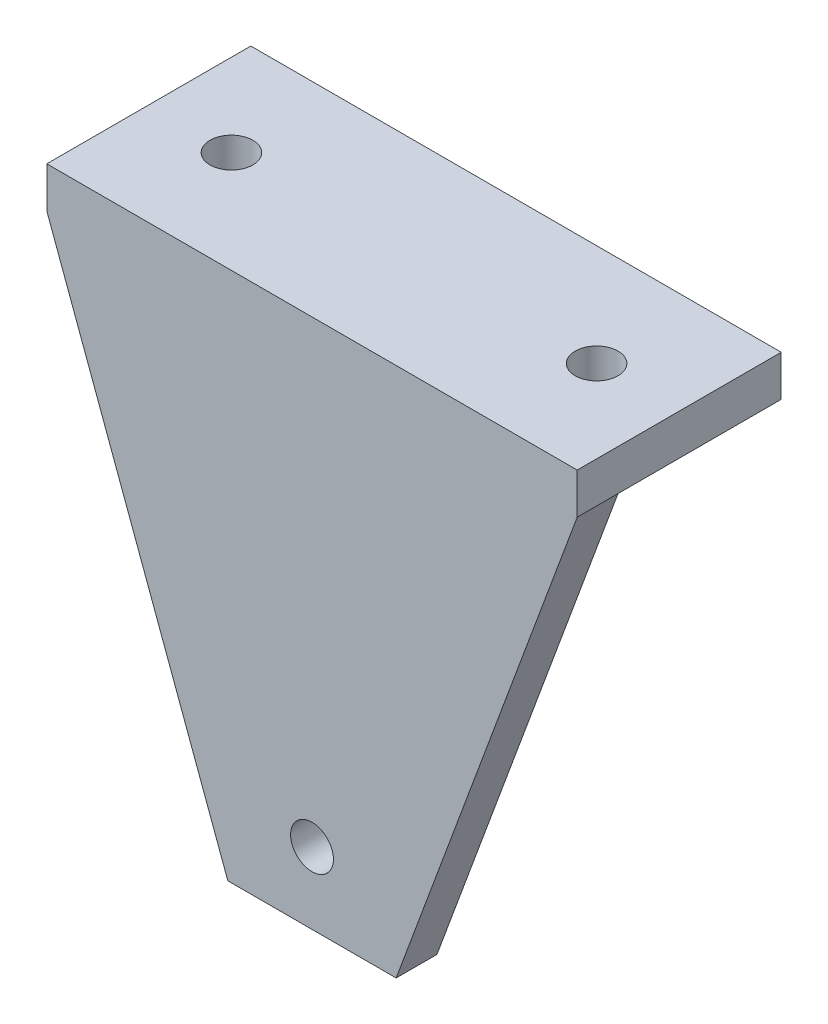
ISO-10303-21;
HEADER;
FILE_DESCRIPTION(('STEP AP214'),'2;1');
FILE_NAME('part.step','',(''),(''),'','','');
FILE_SCHEMA(('AUTOMOTIVE_DESIGN { 1 0 10303 214 1 1 1 1 }'));
ENDSEC;
DATA;
#1=APPLICATION_CONTEXT('core data for automotive mechanical design processes');
#2=APPLICATION_PROTOCOL_DEFINITION('international standard','automotive_design',2000,#1);
#3=PRODUCT_CONTEXT('',#1,'mechanical');
#4=PRODUCT('Part','Part','',(#3));
#5=PRODUCT_RELATED_PRODUCT_CATEGORY('part','',(#4));
#6=PRODUCT_DEFINITION_FORMATION('','',#4);
#7=PRODUCT_DEFINITION_CONTEXT('part definition',#1,'design');
#8=PRODUCT_DEFINITION('design','',#6,#7);
#9=PRODUCT_DEFINITION_SHAPE('','',#8);
#10=(LENGTH_UNIT() NAMED_UNIT(*) SI_UNIT(.MILLI.,.METRE.));
#11=(NAMED_UNIT(*) PLANE_ANGLE_UNIT() SI_UNIT($,.RADIAN.));
#12=(NAMED_UNIT(*) SI_UNIT($,.STERADIAN.) SOLID_ANGLE_UNIT());
#13=UNCERTAINTY_MEASURE_WITH_UNIT(LENGTH_MEASURE(1.E-05),#10,'distance_accuracy_value','');
#14=(GEOMETRIC_REPRESENTATION_CONTEXT(3) GLOBAL_UNCERTAINTY_ASSIGNED_CONTEXT((#13)) GLOBAL_UNIT_ASSIGNED_CONTEXT((#10,
#11,#12)) REPRESENTATION_CONTEXT('',''));
#15=CARTESIAN_POINT('',(0.,0.,0.));
#16=DIRECTION('',(0.,0.,1.));
#17=DIRECTION('',(1.,0.,0.));
#18=AXIS2_PLACEMENT_3D('',#15,#16,#17);
#19=CARTESIAN_POINT('',(0.,0.,0.));
#20=DIRECTION('',(0.,-1.,0.));
#21=DIRECTION('',(0.,0.,-1.));
#22=AXIS2_PLACEMENT_3D('',#19,#20,#21);
#23=PLANE('',#22);
#24=CARTESIAN_POINT('',(8.1,0.,-10.));
#25=DIRECTION('',(0.,1.,0.));
#26=DIRECTION('',(0.,0.,-1.));
#27=AXIS2_PLACEMENT_3D('',#24,#25,#26);
#28=CIRCLE('',#27,2.1);
#29=CARTESIAN_POINT('',(8.1,0.,-12.1));
#30=VERTEX_POINT('',#29);
#31=EDGE_CURVE('E206',#30,#30,#28,.T.);
#32=ORIENTED_EDGE('',*,*,#31,.T.);
#33=EDGE_LOOP('',(#32));
#34=FACE_BOUND('',#33,.T.);
#35=DIRECTION('',(-1.,0.,0.));
#36=VECTOR('',#35,1.);
#37=CARTESIAN_POINT('',(0.,0.,-20.));
#38=LINE('',#37,#36);
#39=CARTESIAN_POINT('',(13.9877317805303,0.,-20.));
#40=VERTEX_POINT('',#39);
#41=CARTESIAN_POINT('',(0.,0.,-20.));
#42=VERTEX_POINT('',#41);
#43=EDGE_CURVE('E77',#40,#42,#38,.T.);
#44=ORIENTED_EDGE('',*,*,#43,.F.);
#45=DIRECTION('',(0.,0.,1.));
#46=VECTOR('',#45,1.);
#47=CARTESIAN_POINT('',(13.9877317805303,0.,-20.));
#48=LINE('',#47,#46);
#49=CARTESIAN_POINT('',(13.9877317805303,0.,-4.00000000000001));
#50=VERTEX_POINT('',#49);
#51=EDGE_CURVE('E259',#40,#50,#48,.T.);
#52=ORIENTED_EDGE('',*,*,#51,.T.);
#53=DIRECTION('',(1.,0.,0.));
#54=VECTOR('',#53,1.);
#55=CARTESIAN_POINT('',(52.,0.,-4.));
#56=LINE('',#55,#54);
#57=CARTESIAN_POINT('',(0.,0.,-4.00000000000001));
#58=VERTEX_POINT('',#57);
#59=EDGE_CURVE('E184',#58,#50,#56,.T.);
#60=ORIENTED_EDGE('',*,*,#59,.F.);
#61=DIRECTION('',(0.,0.,1.));
#62=VECTOR('',#61,1.);
#63=CARTESIAN_POINT('',(0.,0.,0.));
#64=LINE('',#63,#62);
#65=EDGE_CURVE('E218',#42,#58,#64,.T.);
#66=ORIENTED_EDGE('',*,*,#65,.F.);
#67=EDGE_LOOP('',(#44,#52,#60,#66));
#68=FACE_BOUND('',#67,.T.);
#69=ADVANCED_FACE('F38',(#34,#68),#23,.T.);
#70=CARTESIAN_POINT('',(18.,0.,-4.));
#71=VERTEX_POINT('',#70);
#72=CARTESIAN_POINT('',(34.,0.,-4.));
#73=VERTEX_POINT('',#72);
#74=EDGE_CURVE('E182',#71,#73,#56,.T.);
#75=ORIENTED_EDGE('',*,*,#74,.F.);
#76=DIRECTION('',(0.,0.,1.));
#77=VECTOR('',#76,1.);
#78=CARTESIAN_POINT('',(18.,0.,-20.));
#79=LINE('',#78,#77);
#80=CARTESIAN_POINT('',(18.,0.,-20.));
#81=VERTEX_POINT('',#80);
#82=EDGE_CURVE('E262',#81,#71,#79,.T.);
#83=ORIENTED_EDGE('',*,*,#82,.F.);
#84=CARTESIAN_POINT('',(34.,0.,-20.));
#85=VERTEX_POINT('',#84);
#86=EDGE_CURVE('E235',#85,#81,#38,.T.);
#87=ORIENTED_EDGE('',*,*,#86,.F.);
#88=DIRECTION('',(0.,0.,1.));
#89=VECTOR('',#88,1.);
#90=CARTESIAN_POINT('',(34.,0.,-20.));
#91=LINE('',#90,#89);
#92=EDGE_CURVE('E197',#85,#73,#91,.T.);
#93=ORIENTED_EDGE('',*,*,#92,.T.);
#94=EDGE_LOOP('',(#75,#83,#87,#93));
#95=FACE_BOUND('',#94,.T.);
#96=ADVANCED_FACE('F294',(#95),#23,.T.);
#97=CARTESIAN_POINT('',(52.,-48.,-4.));
#98=DIRECTION('',(0.,0.,1.));
#99=DIRECTION('',(1.,0.,0.));
#100=AXIS2_PLACEMENT_3D('',#97,#98,#99);
#101=PLANE('',#100);
#102=DIRECTION('',(-0.078140925400026,0.996942323195092,0.));
#103=VECTOR('',#102,1.);
#104=CARTESIAN_POINT('',(17.75,-48.,-4.));
#105=LINE('',#104,#103);
#106=CARTESIAN_POINT('',(17.75,-48.,-4.));
#107=VERTEX_POINT('',#106);
#108=EDGE_CURVE('E255',#107,#50,#105,.T.);
#109=ORIENTED_EDGE('',*,*,#108,.F.);
#110=DIRECTION('',(0.346837004095032,-0.937925419524593,0.));
#111=VECTOR('',#110,1.);
#112=CARTESIAN_POINT('',(0.,0.,-4.00000000000001));
#113=LINE('',#112,#111);
#114=EDGE_CURVE('E191',#58,#107,#113,.T.);
#115=ORIENTED_EDGE('',*,*,#114,.F.);
#116=ORIENTED_EDGE('',*,*,#59,.T.);
#117=EDGE_LOOP('',(#109,#115,#116));
#118=FACE_BOUND('',#117,.T.);
#119=ADVANCED_FACE('F254',(#118),#101,.F.);
#120=CARTESIAN_POINT('',(26.,-41.,-4.));
#121=DIRECTION('',(0.,0.,1.));
#122=DIRECTION('',(1.,0.,0.));
#123=AXIS2_PLACEMENT_3D('',#120,#121,#122);
#124=CIRCLE('',#123,2.1);
#125=CARTESIAN_POINT('',(28.1,-41.,-4.));
#126=VERTEX_POINT('',#125);
#127=EDGE_CURVE('E190',#126,#126,#124,.F.);
#128=ORIENTED_EDGE('',*,*,#127,.F.);
#129=EDGE_LOOP('',(#128));
#130=FACE_BOUND('',#129,.T.);
#131=DIRECTION('',(0.0781409254000258,-0.996942323195092,0.));
#132=VECTOR('',#131,1.);
#133=CARTESIAN_POINT('',(18.,0.,-4.));
#134=LINE('',#133,#132);
#135=CARTESIAN_POINT('',(21.7622682194698,-48.,-4.));
#136=VERTEX_POINT('',#135);
#137=EDGE_CURVE('E266',#71,#136,#134,.T.);
#138=ORIENTED_EDGE('',*,*,#137,.F.);
#139=ORIENTED_EDGE('',*,*,#74,.T.);
#140=DIRECTION('',(0.0781409254000258,0.996942323195092,0.));
#141=VECTOR('',#140,1.);
#142=CARTESIAN_POINT('',(34.,0.,-4.));
#143=LINE('',#142,#141);
#144=CARTESIAN_POINT('',(30.2377317805303,-48.,-4.));
#145=VERTEX_POINT('',#144);
#146=EDGE_CURVE('E171',#145,#73,#143,.T.);
#147=ORIENTED_EDGE('',*,*,#146,.F.);
#148=DIRECTION('',(1.,0.,0.));
#149=VECTOR('',#148,1.);
#150=CARTESIAN_POINT('',(52.,-48.,-4.));
#151=LINE('',#150,#149);
#152=EDGE_CURVE('E159',#136,#145,#151,.T.);
#153=ORIENTED_EDGE('',*,*,#152,.F.);
#154=EDGE_LOOP('',(#138,#139,#147,#153));
#155=FACE_BOUND('',#154,.T.);
#156=ADVANCED_FACE('F303',(#130,#155),#101,.F.);
#157=CARTESIAN_POINT('',(43.9,0.,-10.));
#158=DIRECTION('',(0.,1.,0.));
#159=DIRECTION('',(0.,0.,1.));
#160=AXIS2_PLACEMENT_3D('',#157,#158,#159);
#161=CIRCLE('',#160,2.1);
#162=CARTESIAN_POINT('',(43.9,0.,-7.9));
#163=VERTEX_POINT('',#162);
#164=EDGE_CURVE('E212',#163,#163,#161,.T.);
#165=ORIENTED_EDGE('',*,*,#164,.T.);
#166=EDGE_LOOP('',(#165));
#167=FACE_BOUND('',#166,.T.);
#168=CARTESIAN_POINT('',(38.0122682194698,0.,-4.));
#169=VERTEX_POINT('',#168);
#170=CARTESIAN_POINT('',(52.,0.,-4.));
#171=VERTEX_POINT('',#170);
#172=EDGE_CURVE('E180',#169,#171,#56,.T.);
#173=ORIENTED_EDGE('',*,*,#172,.F.);
#174=DIRECTION('',(0.,0.,1.));
#175=VECTOR('',#174,1.);
#176=CARTESIAN_POINT('',(38.0122682194698,0.,-20.));
#177=LINE('',#176,#175);
#178=CARTESIAN_POINT('',(38.0122682194698,0.,-20.));
#179=VERTEX_POINT('',#178);
#180=EDGE_CURVE('E167',#179,#169,#177,.T.);
#181=ORIENTED_EDGE('',*,*,#180,.F.);
#182=CARTESIAN_POINT('',(52.,0.,-20.));
#183=VERTEX_POINT('',#182);
#184=EDGE_CURVE('E223',#183,#179,#38,.T.);
#185=ORIENTED_EDGE('',*,*,#184,.F.);
#186=DIRECTION('',(0.,0.,-1.));
#187=VECTOR('',#186,1.);
#188=CARTESIAN_POINT('',(52.,0.,0.));
#189=LINE('',#188,#187);
#190=EDGE_CURVE('E231',#171,#183,#189,.T.);
#191=ORIENTED_EDGE('',*,*,#190,.F.);
#192=EDGE_LOOP('',(#173,#181,#185,#191));
#193=FACE_BOUND('',#192,.T.);
#194=ADVANCED_FACE('F296',(#167,#193),#23,.T.);
#195=DIRECTION('',(-0.078140925400026,-0.996942323195092,0.));
#196=VECTOR('',#195,1.);
#197=CARTESIAN_POINT('',(34.25,-48.,-4.));
#198=LINE('',#197,#196);
#199=CARTESIAN_POINT('',(34.25,-48.,-4.));
#200=VERTEX_POINT('',#199);
#201=EDGE_CURVE('E165',#169,#200,#198,.T.);
#202=ORIENTED_EDGE('',*,*,#201,.F.);
#203=ORIENTED_EDGE('',*,*,#172,.T.);
#204=DIRECTION('',(0.346837004095032,0.937925419524593,0.));
#205=VECTOR('',#204,1.);
#206=CARTESIAN_POINT('',(52.,0.,-4.));
#207=LINE('',#206,#205);
#208=EDGE_CURVE('E175',#200,#171,#207,.T.);
#209=ORIENTED_EDGE('',*,*,#208,.F.);
#210=EDGE_LOOP('',(#202,#203,#209));
#211=FACE_BOUND('',#210,.T.);
#212=ADVANCED_FACE('F179',(#211),#101,.F.);
#213=CARTESIAN_POINT('',(0.,4.,0.));
#214=DIRECTION('',(0.,-1.,0.));
#215=DIRECTION('',(0.,0.,-1.));
#216=AXIS2_PLACEMENT_3D('',#213,#214,#215);
#217=PLANE('',#216);
#218=DIRECTION('',(0.,0.,1.));
#219=VECTOR('',#218,1.);
#220=CARTESIAN_POINT('',(0.,4.,0.));
#221=LINE('',#220,#219);
#222=CARTESIAN_POINT('',(0.,4.,-20.));
#223=VERTEX_POINT('',#222);
#224=CARTESIAN_POINT('',(0.,4.,0.));
#225=VERTEX_POINT('',#224);
#226=EDGE_CURVE('E221',#223,#225,#221,.T.);
#227=ORIENTED_EDGE('',*,*,#226,.T.);
#228=DIRECTION('',(1.,0.,0.));
#229=VECTOR('',#228,1.);
#230=CARTESIAN_POINT('',(0.,4.,0.));
#231=LINE('',#230,#229);
#232=CARTESIAN_POINT('',(52.,4.,0.));
#233=VERTEX_POINT('',#232);
#234=EDGE_CURVE('E85',#225,#233,#231,.T.);
#235=ORIENTED_EDGE('',*,*,#234,.T.);
#236=DIRECTION('',(0.,0.,-1.));
#237=VECTOR('',#236,1.);
#238=CARTESIAN_POINT('',(52.,4.,0.));
#239=LINE('',#238,#237);
#240=CARTESIAN_POINT('',(52.,4.,-20.));
#241=VERTEX_POINT('',#240);
#242=EDGE_CURVE('E225',#233,#241,#239,.T.);
#243=ORIENTED_EDGE('',*,*,#242,.T.);
#244=DIRECTION('',(-1.,0.,0.));
#245=VECTOR('',#244,1.);
#246=CARTESIAN_POINT('',(0.,4.,-20.));
#247=LINE('',#246,#245);
#248=EDGE_CURVE('E62',#241,#223,#247,.T.);
#249=ORIENTED_EDGE('',*,*,#248,.T.);
#250=EDGE_LOOP('',(#227,#235,#243,#249));
#251=FACE_BOUND('',#250,.T.);
#252=CARTESIAN_POINT('',(43.9,4.,-10.));
#253=DIRECTION('',(0.,1.,0.));
#254=DIRECTION('',(0.,0.,1.));
#255=AXIS2_PLACEMENT_3D('',#252,#253,#254);
#256=CIRCLE('',#255,2.1);
#257=CARTESIAN_POINT('',(43.9,4.,-7.9));
#258=VERTEX_POINT('',#257);
#259=EDGE_CURVE('E215',#258,#258,#256,.T.);
#260=ORIENTED_EDGE('',*,*,#259,.F.);
#261=EDGE_LOOP('',(#260));
#262=FACE_BOUND('',#261,.T.);
#263=CARTESIAN_POINT('',(8.1,4.,-10.));
#264=DIRECTION('',(0.,1.,0.));
#265=DIRECTION('',(0.,0.,-1.));
#266=AXIS2_PLACEMENT_3D('',#263,#264,#265);
#267=CIRCLE('',#266,2.1);
#268=CARTESIAN_POINT('',(8.1,4.,-12.1));
#269=VERTEX_POINT('',#268);
#270=EDGE_CURVE('E209',#269,#269,#267,.T.);
#271=ORIENTED_EDGE('',*,*,#270,.F.);
#272=EDGE_LOOP('',(#271));
#273=FACE_BOUND('',#272,.T.);
#274=ADVANCED_FACE('F278',(#251,#262,#273),#217,.F.);
#275=CARTESIAN_POINT('',(0.,4.,0.));
#276=DIRECTION('',(1.,0.,0.));
#277=DIRECTION('',(0.,0.,-1.));
#278=AXIS2_PLACEMENT_3D('',#275,#276,#277);
#279=PLANE('',#278);
#280=ORIENTED_EDGE('',*,*,#65,.T.);
#281=DIRECTION('',(0.,0.,1.));
#282=VECTOR('',#281,1.);
#283=CARTESIAN_POINT('',(0.,0.,-20.001));
#284=LINE('',#283,#282);
#285=CARTESIAN_POINT('',(0.,0.,0.));
#286=VERTEX_POINT('',#285);
#287=EDGE_CURVE('E198',#58,#286,#284,.T.);
#288=ORIENTED_EDGE('',*,*,#287,.T.);
#289=DIRECTION('',(0.,-1.,0.));
#290=VECTOR('',#289,1.);
#291=CARTESIAN_POINT('',(0.,4.,0.));
#292=LINE('',#291,#290);
#293=EDGE_CURVE('E46',#225,#286,#292,.T.);
#294=ORIENTED_EDGE('',*,*,#293,.F.);
#295=ORIENTED_EDGE('',*,*,#226,.F.);
#296=DIRECTION('',(0.,-1.,0.));
#297=VECTOR('',#296,1.);
#298=CARTESIAN_POINT('',(0.,4.,-20.));
#299=LINE('',#298,#297);
#300=EDGE_CURVE('E228',#223,#42,#299,.T.);
#301=ORIENTED_EDGE('',*,*,#300,.T.);
#302=EDGE_LOOP('',(#280,#288,#294,#295,#301));
#303=FACE_BOUND('',#302,.T.);
#304=ADVANCED_FACE('F40',(#303),#279,.F.);
#305=CARTESIAN_POINT('',(0.,4.,0.));
#306=DIRECTION('',(0.,0.,-1.));
#307=DIRECTION('',(-1.,0.,0.));
#308=AXIS2_PLACEMENT_3D('',#305,#306,#307);
#309=PLANE('',#308);
#310=CARTESIAN_POINT('',(26.,-41.,0.));
#311=DIRECTION('',(0.,0.,1.));
#312=DIRECTION('',(1.,0.,0.));
#313=AXIS2_PLACEMENT_3D('',#310,#311,#312);
#314=CIRCLE('',#313,2.1);
#315=CARTESIAN_POINT('',(28.1,-41.,0.));
#316=VERTEX_POINT('',#315);
#317=EDGE_CURVE('E187',#316,#316,#314,.T.);
#318=ORIENTED_EDGE('',*,*,#317,.F.);
#319=EDGE_LOOP('',(#318));
#320=FACE_BOUND('',#319,.T.);
#321=DIRECTION('',(-1.,0.,0.));
#322=VECTOR('',#321,1.);
#323=CARTESIAN_POINT('',(52.,-48.,0.));
#324=LINE('',#323,#322);
#325=CARTESIAN_POINT('',(34.25,-48.,0.));
#326=VERTEX_POINT('',#325);
#327=CARTESIAN_POINT('',(17.75,-48.,0.));
#328=VERTEX_POINT('',#327);
#329=EDGE_CURVE('E204',#326,#328,#324,.T.);
#330=ORIENTED_EDGE('',*,*,#329,.F.);
#331=DIRECTION('',(-0.346837004095032,-0.937925419524593,0.));
#332=VECTOR('',#331,1.);
#333=CARTESIAN_POINT('',(52.,0.,0.));
#334=LINE('',#333,#332);
#335=CARTESIAN_POINT('',(52.,0.,0.));
#336=VERTEX_POINT('',#335);
#337=EDGE_CURVE('E53',#336,#326,#334,.T.);
#338=ORIENTED_EDGE('',*,*,#337,.F.);
#339=DIRECTION('',(0.,-1.,0.));
#340=VECTOR('',#339,1.);
#341=CARTESIAN_POINT('',(52.,4.,0.));
#342=LINE('',#341,#340);
#343=EDGE_CURVE('E240',#233,#336,#342,.T.);
#344=ORIENTED_EDGE('',*,*,#343,.F.);
#345=ORIENTED_EDGE('',*,*,#234,.F.);
#346=ORIENTED_EDGE('',*,*,#293,.T.);
#347=DIRECTION('',(-0.346837004095032,0.937925419524593,0.));
#348=VECTOR('',#347,1.);
#349=CARTESIAN_POINT('',(0.,0.,0.));
#350=LINE('',#349,#348);
#351=EDGE_CURVE('E194',#328,#286,#350,.T.);
#352=ORIENTED_EDGE('',*,*,#351,.F.);
#353=EDGE_LOOP('',(#330,#338,#344,#345,#346,#352));
#354=FACE_BOUND('',#353,.T.);
#355=ADVANCED_FACE('F244',(#320,#354),#309,.F.);
#356=CARTESIAN_POINT('',(52.,4.,0.));
#357=DIRECTION('',(-1.,0.,0.));
#358=DIRECTION('',(0.,0.,1.));
#359=AXIS2_PLACEMENT_3D('',#356,#357,#358);
#360=PLANE('',#359);
#361=ORIENTED_EDGE('',*,*,#343,.T.);
#362=DIRECTION('',(0.,0.,1.));
#363=VECTOR('',#362,1.);
#364=CARTESIAN_POINT('',(52.,0.,-20.001));
#365=LINE('',#364,#363);
#366=EDGE_CURVE('E177',#171,#336,#365,.T.);
#367=ORIENTED_EDGE('',*,*,#366,.F.);
#368=ORIENTED_EDGE('',*,*,#190,.T.);
#369=DIRECTION('',(0.,-1.,0.));
#370=VECTOR('',#369,1.);
#371=CARTESIAN_POINT('',(52.,4.,-20.));
#372=LINE('',#371,#370);
#373=EDGE_CURVE('E237',#241,#183,#372,.T.);
#374=ORIENTED_EDGE('',*,*,#373,.F.);
#375=ORIENTED_EDGE('',*,*,#242,.F.);
#376=EDGE_LOOP('',(#361,#367,#368,#374,#375));
#377=FACE_BOUND('',#376,.T.);
#378=ADVANCED_FACE('F276',(#377),#360,.F.);
#379=CARTESIAN_POINT('',(0.,4.,-20.));
#380=DIRECTION('',(0.,0.,1.));
#381=DIRECTION('',(1.,0.,0.));
#382=AXIS2_PLACEMENT_3D('',#379,#380,#381);
#383=PLANE('',#382);
#384=ORIENTED_EDGE('',*,*,#184,.T.);
#385=DIRECTION('',(-1.,0.,0.));
#386=VECTOR('',#385,1.);
#387=CARTESIAN_POINT('',(52.,0.,-20.));
#388=LINE('',#387,#386);
#389=EDGE_CURVE('E143',#179,#85,#388,.T.);
#390=ORIENTED_EDGE('',*,*,#389,.T.);
#391=ORIENTED_EDGE('',*,*,#86,.T.);
#392=EDGE_CURVE('E161',#81,#40,#388,.T.);
#393=ORIENTED_EDGE('',*,*,#392,.T.);
#394=ORIENTED_EDGE('',*,*,#43,.T.);
#395=ORIENTED_EDGE('',*,*,#300,.F.);
#396=ORIENTED_EDGE('',*,*,#248,.F.);
#397=ORIENTED_EDGE('',*,*,#373,.T.);
#398=EDGE_LOOP('',(#384,#390,#391,#393,#394,#395,#396,#397));
#399=FACE_BOUND('',#398,.T.);
#400=ADVANCED_FACE('F314',(#399),#383,.F.);
#401=CARTESIAN_POINT('',(43.9,4.,-10.));
#402=DIRECTION('',(0.,-1.,0.));
#403=DIRECTION('',(0.,0.,-1.));
#404=AXIS2_PLACEMENT_3D('',#401,#402,#403);
#405=CYLINDRICAL_SURFACE('',#404,2.1);
#406=ORIENTED_EDGE('',*,*,#259,.T.);
#407=EDGE_LOOP('',(#406));
#408=FACE_BOUND('',#407,.T.);
#409=ORIENTED_EDGE('',*,*,#164,.F.);
#410=EDGE_LOOP('',(#409));
#411=FACE_BOUND('',#410,.T.);
#412=ADVANCED_FACE('F289',(#408,#411),#405,.F.);
#413=CARTESIAN_POINT('',(8.1,4.,-10.));
#414=DIRECTION('',(0.,-1.,0.));
#415=DIRECTION('',(0.,0.,-1.));
#416=AXIS2_PLACEMENT_3D('',#413,#414,#415);
#417=CYLINDRICAL_SURFACE('',#416,2.1);
#418=ORIENTED_EDGE('',*,*,#270,.T.);
#419=EDGE_LOOP('',(#418));
#420=FACE_BOUND('',#419,.T.);
#421=ORIENTED_EDGE('',*,*,#31,.F.);
#422=EDGE_LOOP('',(#421));
#423=FACE_BOUND('',#422,.T.);
#424=ADVANCED_FACE('F286',(#420,#423),#417,.F.);
#425=CARTESIAN_POINT('',(0.,-48.,0.));
#426=DIRECTION('',(0.,1.,0.));
#427=DIRECTION('',(0.,0.,1.));
#428=AXIS2_PLACEMENT_3D('',#425,#426,#427);
#429=PLANE('',#428);
#430=DIRECTION('',(0.,0.,1.));
#431=VECTOR('',#430,1.);
#432=CARTESIAN_POINT('',(17.75,-48.,-20.001));
#433=LINE('',#432,#431);
#434=EDGE_CURVE('E196',#107,#328,#433,.T.);
#435=ORIENTED_EDGE('',*,*,#434,.F.);
#436=DIRECTION('',(-1.,0.,0.));
#437=VECTOR('',#436,1.);
#438=CARTESIAN_POINT('',(52.,-48.,-4.));
#439=LINE('',#438,#437);
#440=EDGE_CURVE('E162',#136,#107,#439,.T.);
#441=ORIENTED_EDGE('',*,*,#440,.F.);
#442=ORIENTED_EDGE('',*,*,#152,.T.);
#443=EDGE_CURVE('E140',#200,#145,#439,.T.);
#444=ORIENTED_EDGE('',*,*,#443,.F.);
#445=DIRECTION('',(0.,0.,1.));
#446=VECTOR('',#445,1.);
#447=CARTESIAN_POINT('',(34.25,-48.,-20.001));
#448=LINE('',#447,#446);
#449=EDGE_CURVE('E155',#200,#326,#448,.T.);
#450=ORIENTED_EDGE('',*,*,#449,.T.);
#451=ORIENTED_EDGE('',*,*,#329,.T.);
#452=EDGE_LOOP('',(#435,#441,#442,#444,#450,#451));
#453=FACE_BOUND('',#452,.T.);
#454=ADVANCED_FACE('F153',(#453),#429,.F.);
#455=CARTESIAN_POINT('',(0.,0.,-20.001));
#456=DIRECTION('',(0.937925419524593,0.346837004095032,0.));
#457=DIRECTION('',(-0.346837004095032,0.937925419524593,0.));
#458=AXIS2_PLACEMENT_3D('',#455,#456,#457);
#459=PLANE('',#458);
#460=ORIENTED_EDGE('',*,*,#114,.T.);
#461=ORIENTED_EDGE('',*,*,#434,.T.);
#462=ORIENTED_EDGE('',*,*,#351,.T.);
#463=ORIENTED_EDGE('',*,*,#287,.F.);
#464=EDGE_LOOP('',(#460,#461,#462,#463));
#465=FACE_BOUND('',#464,.T.);
#466=ADVANCED_FACE('F250',(#465),#459,.F.);
#467=CARTESIAN_POINT('',(52.,0.,-20.001));
#468=DIRECTION('',(-0.937925419524593,0.346837004095032,0.));
#469=DIRECTION('',(-0.346837004095032,-0.937925419524593,0.));
#470=AXIS2_PLACEMENT_3D('',#467,#468,#469);
#471=PLANE('',#470);
#472=ORIENTED_EDGE('',*,*,#208,.T.);
#473=ORIENTED_EDGE('',*,*,#366,.T.);
#474=ORIENTED_EDGE('',*,*,#337,.T.);
#475=ORIENTED_EDGE('',*,*,#449,.F.);
#476=EDGE_LOOP('',(#472,#473,#474,#475));
#477=FACE_BOUND('',#476,.T.);
#478=ADVANCED_FACE('F174',(#477),#471,.F.);
#479=CARTESIAN_POINT('',(26.,-41.,-20.001));
#480=DIRECTION('',(0.,0.,1.));
#481=DIRECTION('',(1.,0.,0.));
#482=AXIS2_PLACEMENT_3D('',#479,#480,#481);
#483=CYLINDRICAL_SURFACE('',#482,2.1);
#484=ORIENTED_EDGE('',*,*,#317,.T.);
#485=EDGE_LOOP('',(#484));
#486=FACE_BOUND('',#485,.T.);
#487=ORIENTED_EDGE('',*,*,#127,.T.);
#488=EDGE_LOOP('',(#487));
#489=FACE_BOUND('',#488,.T.);
#490=ADVANCED_FACE('F346',(#486,#489),#483,.F.);
#491=CARTESIAN_POINT('',(34.,0.,-20.));
#492=DIRECTION('',(0.996942323195092,-0.0781409254000258,0.));
#493=DIRECTION('',(0.0781409254000258,0.996942323195092,0.));
#494=AXIS2_PLACEMENT_3D('',#491,#492,#493);
#495=PLANE('',#494);
#496=ORIENTED_EDGE('',*,*,#92,.F.);
#497=DIRECTION('',(-0.0741536333980668,-0.946071411040667,0.315357137013556));
#498=VECTOR('',#497,1.);
#499=CARTESIAN_POINT('',(34.,0.,-20.));
#500=LINE('',#499,#498);
#501=EDGE_CURVE('E147',#85,#145,#500,.T.);
#502=ORIENTED_EDGE('',*,*,#501,.T.);
#503=ORIENTED_EDGE('',*,*,#146,.T.);
#504=EDGE_LOOP('',(#496,#502,#503));
#505=FACE_BOUND('',#504,.T.);
#506=ADVANCED_FACE('F320',(#505),#495,.F.);
#507=CARTESIAN_POINT('',(34.25,-48.,-20.));
#508=DIRECTION('',(-0.996942323195092,0.078140925400026,0.));
#509=DIRECTION('',(-0.078140925400026,-0.996942323195092,0.));
#510=AXIS2_PLACEMENT_3D('',#507,#508,#509);
#511=PLANE('',#510);
#512=ORIENTED_EDGE('',*,*,#201,.T.);
#513=DIRECTION('',(0.074153633398067,0.946071411040667,-0.315357137013556));
#514=VECTOR('',#513,1.);
#515=CARTESIAN_POINT('',(34.6241580404411,-43.2263940544615,-5.59120198184619));
#516=LINE('',#515,#514);
#517=EDGE_CURVE('E137',#200,#179,#516,.T.);
#518=ORIENTED_EDGE('',*,*,#517,.T.);
#519=ORIENTED_EDGE('',*,*,#180,.T.);
#520=EDGE_LOOP('',(#512,#518,#519));
#521=FACE_BOUND('',#520,.T.);
#522=ADVANCED_FACE('F166',(#521),#511,.F.);
#523=CARTESIAN_POINT('',(17.75,-48.,-20.));
#524=DIRECTION('',(0.996942323195092,0.078140925400026,0.));
#525=DIRECTION('',(-0.078140925400026,0.996942323195092,0.));
#526=AXIS2_PLACEMENT_3D('',#523,#524,#525);
#527=PLANE('',#526);
#528=ORIENTED_EDGE('',*,*,#51,.F.);
#529=DIRECTION('',(0.0741536333980669,-0.946071411040667,0.315357137013556));
#530=VECTOR('',#529,1.);
#531=CARTESIAN_POINT('',(17.375841959559,-43.2263940544615,-5.59120198184619));
#532=LINE('',#531,#530);
#533=EDGE_CURVE('E148',#40,#107,#532,.T.);
#534=ORIENTED_EDGE('',*,*,#533,.T.);
#535=ORIENTED_EDGE('',*,*,#108,.T.);
#536=EDGE_LOOP('',(#528,#534,#535));
#537=FACE_BOUND('',#536,.T.);
#538=ADVANCED_FACE('F333',(#537),#527,.F.);
#539=CARTESIAN_POINT('',(18.,0.,-20.));
#540=DIRECTION('',(-0.996942323195092,-0.0781409254000258,0.));
#541=DIRECTION('',(0.0781409254000258,-0.996942323195092,0.));
#542=AXIS2_PLACEMENT_3D('',#539,#540,#541);
#543=PLANE('',#542);
#544=ORIENTED_EDGE('',*,*,#137,.T.);
#545=DIRECTION('',(-0.0741536333980667,0.946071411040667,-0.315357137013556));
#546=VECTOR('',#545,1.);
#547=CARTESIAN_POINT('',(18.,0.,-20.));
#548=LINE('',#547,#546);
#549=EDGE_CURVE('E11',#136,#81,#548,.T.);
#550=ORIENTED_EDGE('',*,*,#549,.T.);
#551=ORIENTED_EDGE('',*,*,#82,.T.);
#552=EDGE_LOOP('',(#544,#550,#551));
#553=FACE_BOUND('',#552,.T.);
#554=ADVANCED_FACE('F326',(#553),#543,.F.);
#555=CARTESIAN_POINT('',(52.,0.,-20.));
#556=DIRECTION('',(0.,0.316227766016838,0.948683298050514));
#557=DIRECTION('',(0.,-0.948683298050514,0.316227766016838));
#558=AXIS2_PLACEMENT_3D('',#555,#556,#557);
#559=PLANE('',#558);
#560=ORIENTED_EDGE('',*,*,#392,.F.);
#561=ORIENTED_EDGE('',*,*,#549,.F.);
#562=ORIENTED_EDGE('',*,*,#440,.T.);
#563=ORIENTED_EDGE('',*,*,#533,.F.);
#564=EDGE_LOOP('',(#560,#561,#562,#563));
#565=FACE_BOUND('',#564,.T.);
#566=ADVANCED_FACE('F332',(#565),#559,.F.);
#567=ORIENTED_EDGE('',*,*,#389,.F.);
#568=ORIENTED_EDGE('',*,*,#517,.F.);
#569=ORIENTED_EDGE('',*,*,#443,.T.);
#570=ORIENTED_EDGE('',*,*,#501,.F.);
#571=EDGE_LOOP('',(#567,#568,#569,#570));
#572=FACE_BOUND('',#571,.T.);
#573=ADVANCED_FACE('F139',(#572),#559,.F.);
#574=CLOSED_SHELL('',(#69,#96,#119,#156,#194,#212,#274,#304,#355,#378,#400,#412,#424,#454,#466,
#478,#490,#506,#522,#538,#554,#566,#573));
#575=MANIFOLD_SOLID_BREP('B2',#574);
#576=ADVANCED_BREP_SHAPE_REPRESENTATION('',(#18,#575),#14);
#577=SHAPE_DEFINITION_REPRESENTATION(#9,#576);
ENDSEC;
END-ISO-10303-21;
